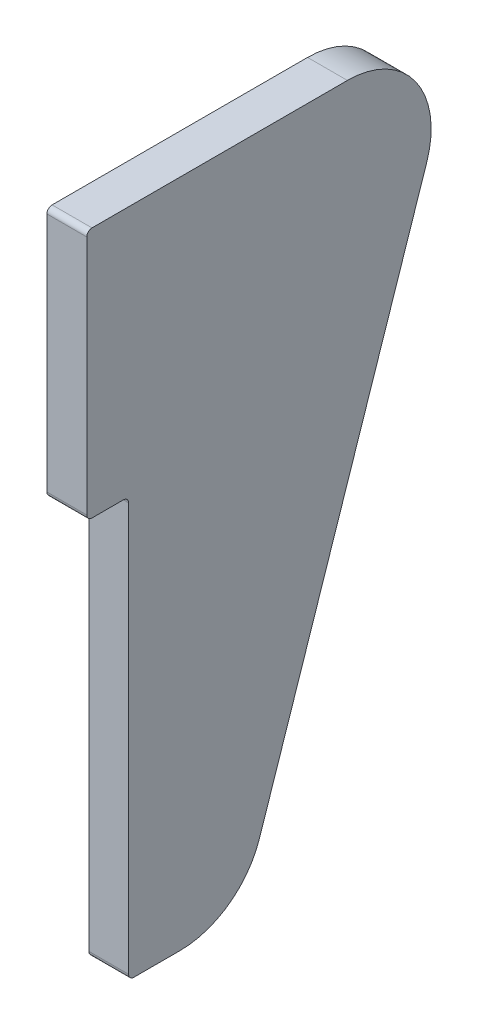
ISO-10303-21;
HEADER;
FILE_DESCRIPTION(('STEP AP214'),'2;1');
FILE_NAME('part.step','',(''),(''),'','','');
FILE_SCHEMA(('AUTOMOTIVE_DESIGN { 1 0 10303 214 1 1 1 1 }'));
ENDSEC;
DATA;
#1=APPLICATION_CONTEXT('core data for automotive mechanical design processes');
#2=APPLICATION_PROTOCOL_DEFINITION('international standard','automotive_design',2000,#1);
#3=PRODUCT_CONTEXT('',#1,'mechanical');
#4=PRODUCT('Part','Part','',(#3));
#5=PRODUCT_RELATED_PRODUCT_CATEGORY('part','',(#4));
#6=PRODUCT_DEFINITION_FORMATION('','',#4);
#7=PRODUCT_DEFINITION_CONTEXT('part definition',#1,'design');
#8=PRODUCT_DEFINITION('design','',#6,#7);
#9=PRODUCT_DEFINITION_SHAPE('','',#8);
#10=(LENGTH_UNIT() NAMED_UNIT(*) SI_UNIT(.MILLI.,.METRE.));
#11=(NAMED_UNIT(*) PLANE_ANGLE_UNIT() SI_UNIT($,.RADIAN.));
#12=(NAMED_UNIT(*) SI_UNIT($,.STERADIAN.) SOLID_ANGLE_UNIT());
#13=UNCERTAINTY_MEASURE_WITH_UNIT(LENGTH_MEASURE(1.E-05),#10,'distance_accuracy_value','');
#14=(GEOMETRIC_REPRESENTATION_CONTEXT(3) GLOBAL_UNCERTAINTY_ASSIGNED_CONTEXT((#13)) GLOBAL_UNIT_ASSIGNED_CONTEXT((#10,
#11,#12)) REPRESENTATION_CONTEXT('',''));
#15=CARTESIAN_POINT('',(0.,0.,0.));
#16=DIRECTION('',(0.,0.,1.));
#17=DIRECTION('',(1.,0.,0.));
#18=AXIS2_PLACEMENT_3D('',#15,#16,#17);
#19=CARTESIAN_POINT('',(-3.0226,0.,-25.4));
#20=DIRECTION('',(0.,1.,0.));
#21=DIRECTION('',(0.,0.,1.));
#22=AXIS2_PLACEMENT_3D('',#19,#20,#21);
#23=PLANE('',#22);
#24=DIRECTION('',(0.,0.,1.));
#25=VECTOR('',#24,1.);
#26=CARTESIAN_POINT('',(-3.0226,0.,0.));
#27=LINE('',#26,#25);
#28=CARTESIAN_POINT('',(-3.0226,0.,-16.5898456193103));
#29=VERTEX_POINT('',#28);
#30=CARTESIAN_POINT('',(-3.0226,0.,2.778125));
#31=VERTEX_POINT('',#30);
#32=EDGE_CURVE('E259',#29,#31,#27,.T.);
#33=ORIENTED_EDGE('',*,*,#32,.T.);
#34=DIRECTION('',(1.,0.,0.));
#35=VECTOR('',#34,1.);
#36=CARTESIAN_POINT('',(-3.0226,0.,2.778125));
#37=LINE('',#36,#35);
#38=CARTESIAN_POINT('',(0.,0.,2.778125));
#39=VERTEX_POINT('',#38);
#40=EDGE_CURVE('E191',#31,#39,#37,.T.);
#41=ORIENTED_EDGE('',*,*,#40,.T.);
#42=DIRECTION('',(0.,0.,1.));
#43=VECTOR('',#42,1.);
#44=CARTESIAN_POINT('',(0.,0.,-25.4));
#45=LINE('',#44,#43);
#46=CARTESIAN_POINT('',(0.,0.,-16.5898456193103));
#47=VERTEX_POINT('',#46);
#48=EDGE_CURVE('E174',#47,#39,#45,.T.);
#49=ORIENTED_EDGE('',*,*,#48,.F.);
#50=DIRECTION('',(1.,0.,0.));
#51=VECTOR('',#50,1.);
#52=CARTESIAN_POINT('',(-3.0226,0.,-16.5898456193103));
#53=LINE('',#52,#51);
#54=EDGE_CURVE('E188',#47,#29,#53,.F.);
#55=ORIENTED_EDGE('',*,*,#54,.T.);
#56=EDGE_LOOP('',(#33,#41,#49,#55));
#57=FACE_BOUND('',#56,.T.);
#58=ADVANCED_FACE('F45',(#57),#23,.T.);
#59=CARTESIAN_POINT('',(-3.0226,-50.8,-8.46666666666667));
#60=DIRECTION('',(0.,-0.316227766016838,-0.948683298050514));
#61=DIRECTION('',(0.,0.948683298050514,-0.316227766016838));
#62=AXIS2_PLACEMENT_3D('',#59,#60,#61);
#63=PLANE('',#62);
#64=DIRECTION('',(0.,0.948683298050514,-0.316227766016838));
#65=VECTOR('',#64,1.);
#66=CARTESIAN_POINT('',(0.,-50.8,-8.46666666666667));
#67=LINE('',#66,#65);
#68=CARTESIAN_POINT('',(0.,-46.4580463142069,-9.91398456193104));
#69=VERTEX_POINT('',#68);
#70=CARTESIAN_POINT('',(0.,-8.35804631420692,-22.613984561931));
#71=VERTEX_POINT('',#70);
#72=EDGE_CURVE('E147',#69,#71,#67,.T.);
#73=ORIENTED_EDGE('',*,*,#72,.F.);
#74=DIRECTION('',(1.,0.,0.));
#75=VECTOR('',#74,1.);
#76=CARTESIAN_POINT('',(-3.0226,-46.4580463142069,-9.91398456193104));
#77=LINE('',#76,#75);
#78=CARTESIAN_POINT('',(-3.0226,-46.4580463142069,-9.91398456193104));
#79=VERTEX_POINT('',#78);
#80=EDGE_CURVE('E156',#69,#79,#77,.F.);
#81=ORIENTED_EDGE('',*,*,#80,.T.);
#82=DIRECTION('',(0.,0.948683298050514,-0.316227766016838));
#83=VECTOR('',#82,1.);
#84=CARTESIAN_POINT('',(-3.0226,-50.8,-8.46666666666667));
#85=LINE('',#84,#83);
#86=CARTESIAN_POINT('',(-3.0226,-8.35804631420692,-22.613984561931));
#87=VERTEX_POINT('',#86);
#88=EDGE_CURVE('E166',#79,#87,#85,.T.);
#89=ORIENTED_EDGE('',*,*,#88,.T.);
#90=DIRECTION('',(1.,0.,0.));
#91=VECTOR('',#90,1.);
#92=CARTESIAN_POINT('',(-3.0226,-8.35804631420692,-22.613984561931));
#93=LINE('',#92,#91);
#94=EDGE_CURVE('E158',#87,#71,#93,.T.);
#95=ORIENTED_EDGE('',*,*,#94,.T.);
#96=EDGE_LOOP('',(#73,#81,#89,#95));
#97=FACE_BOUND('',#96,.T.);
#98=ADVANCED_FACE('F300',(#97),#63,.T.);
#99=CARTESIAN_POINT('',(-3.0226,-50.8,0.));
#100=DIRECTION('',(0.,-1.,0.));
#101=DIRECTION('',(0.,0.,-1.));
#102=AXIS2_PLACEMENT_3D('',#99,#100,#101);
#103=PLANE('',#102);
#104=DIRECTION('',(0.,0.,-1.));
#105=VECTOR('',#104,1.);
#106=CARTESIAN_POINT('',(0.,-50.8,0.));
#107=LINE('',#106,#105);
#108=CARTESIAN_POINT('',(0.,-50.8,-0.396875000000006));
#109=VERTEX_POINT('',#108);
#110=CARTESIAN_POINT('',(0.,-50.8,-3.88984561931027));
#111=VERTEX_POINT('',#110);
#112=EDGE_CURVE('E134',#109,#111,#107,.T.);
#113=ORIENTED_EDGE('',*,*,#112,.F.);
#114=DIRECTION('',(1.,0.,0.));
#115=VECTOR('',#114,1.);
#116=CARTESIAN_POINT('',(-3.0226,-50.8,-0.396875000000006));
#117=LINE('',#116,#115);
#118=CARTESIAN_POINT('',(-3.0226,-50.8,-0.396875000000006));
#119=VERTEX_POINT('',#118);
#120=EDGE_CURVE('E232',#109,#119,#117,.F.);
#121=ORIENTED_EDGE('',*,*,#120,.T.);
#122=DIRECTION('',(0.,0.,-1.));
#123=VECTOR('',#122,1.);
#124=CARTESIAN_POINT('',(-3.0226,-50.8,0.));
#125=LINE('',#124,#123);
#126=CARTESIAN_POINT('',(-3.0226,-50.8,-3.88984561931027));
#127=VERTEX_POINT('',#126);
#128=EDGE_CURVE('E163',#119,#127,#125,.T.);
#129=ORIENTED_EDGE('',*,*,#128,.T.);
#130=DIRECTION('',(1.,0.,0.));
#131=VECTOR('',#130,1.);
#132=CARTESIAN_POINT('',(-3.0226,-50.8,-3.88984561931027));
#133=LINE('',#132,#131);
#134=EDGE_CURVE('E155',#127,#111,#133,.T.);
#135=ORIENTED_EDGE('',*,*,#134,.T.);
#136=EDGE_LOOP('',(#113,#121,#129,#135));
#137=FACE_BOUND('',#136,.T.);
#138=ADVANCED_FACE('F161',(#137),#103,.T.);
#139=CARTESIAN_POINT('',(-3.0226,-19.05,0.));
#140=DIRECTION('',(0.,0.,1.));
#141=DIRECTION('',(0.,-1.,0.));
#142=AXIS2_PLACEMENT_3D('',#139,#140,#141);
#143=PLANE('',#142);
#144=DIRECTION('',(0.,-1.,0.));
#145=VECTOR('',#144,1.);
#146=CARTESIAN_POINT('',(0.,-19.05,0.));
#147=LINE('',#146,#145);
#148=CARTESIAN_POINT('',(0.,-19.446875,0.));
#149=VERTEX_POINT('',#148);
#150=CARTESIAN_POINT('',(0.,-50.403125,0.));
#151=VERTEX_POINT('',#150);
#152=EDGE_CURVE('E148',#149,#151,#147,.T.);
#153=ORIENTED_EDGE('',*,*,#152,.F.);
#154=DIRECTION('',(1.,0.,0.));
#155=VECTOR('',#154,1.);
#156=CARTESIAN_POINT('',(-3.0226,-19.446875,0.));
#157=LINE('',#156,#155);
#158=CARTESIAN_POINT('',(-3.0226,-19.446875,0.));
#159=VERTEX_POINT('',#158);
#160=EDGE_CURVE('E229',#149,#159,#157,.F.);
#161=ORIENTED_EDGE('',*,*,#160,.T.);
#162=DIRECTION('',(0.,-1.,0.));
#163=VECTOR('',#162,1.);
#164=CARTESIAN_POINT('',(-3.0226,-19.05,0.));
#165=LINE('',#164,#163);
#166=CARTESIAN_POINT('',(-3.0226,-50.403125,0.));
#167=VERTEX_POINT('',#166);
#168=EDGE_CURVE('E252',#159,#167,#165,.T.);
#169=ORIENTED_EDGE('',*,*,#168,.T.);
#170=DIRECTION('',(1.,0.,0.));
#171=VECTOR('',#170,1.);
#172=CARTESIAN_POINT('',(-3.0226,-50.403125,0.));
#173=LINE('',#172,#171);
#174=EDGE_CURVE('E225',#167,#151,#173,.T.);
#175=ORIENTED_EDGE('',*,*,#174,.T.);
#176=EDGE_LOOP('',(#153,#161,#169,#175));
#177=FACE_BOUND('',#176,.T.);
#178=ADVANCED_FACE('F242',(#177),#143,.T.);
#179=CARTESIAN_POINT('',(-3.0226,-19.05,0.));
#180=DIRECTION('',(0.,-1.,0.));
#181=DIRECTION('',(0.,0.,-1.));
#182=AXIS2_PLACEMENT_3D('',#179,#180,#181);
#183=PLANE('',#182);
#184=DIRECTION('',(0.,0.,-1.));
#185=VECTOR('',#184,1.);
#186=CARTESIAN_POINT('',(-3.0226,-19.05,0.));
#187=LINE('',#186,#185);
#188=CARTESIAN_POINT('',(-3.0226,-19.05,2.778125));
#189=VERTEX_POINT('',#188);
#190=CARTESIAN_POINT('',(-3.0226,-19.05,0.396874999999998));
#191=VERTEX_POINT('',#190);
#192=EDGE_CURVE('E249',#189,#191,#187,.T.);
#193=ORIENTED_EDGE('',*,*,#192,.T.);
#194=DIRECTION('',(1.,0.,0.));
#195=VECTOR('',#194,1.);
#196=CARTESIAN_POINT('',(0.,-19.05,0.396874999999998));
#197=LINE('',#196,#195);
#198=CARTESIAN_POINT('',(0.,-19.05,0.396874999999998));
#199=VERTEX_POINT('',#198);
#200=EDGE_CURVE('E221',#191,#199,#197,.T.);
#201=ORIENTED_EDGE('',*,*,#200,.T.);
#202=DIRECTION('',(0.,0.,-1.));
#203=VECTOR('',#202,1.);
#204=CARTESIAN_POINT('',(0.,-19.05,0.));
#205=LINE('',#204,#203);
#206=CARTESIAN_POINT('',(0.,-19.05,2.778125));
#207=VERTEX_POINT('',#206);
#208=EDGE_CURVE('E237',#207,#199,#205,.T.);
#209=ORIENTED_EDGE('',*,*,#208,.F.);
#210=DIRECTION('',(1.,0.,0.));
#211=VECTOR('',#210,1.);
#212=CARTESIAN_POINT('',(-3.0226,-19.05,2.778125));
#213=LINE('',#212,#211);
#214=EDGE_CURVE('E66',#207,#189,#213,.F.);
#215=ORIENTED_EDGE('',*,*,#214,.T.);
#216=EDGE_LOOP('',(#193,#201,#209,#215));
#217=FACE_BOUND('',#216,.T.);
#218=ADVANCED_FACE('F248',(#217),#183,.T.);
#219=CARTESIAN_POINT('',(-3.0226,0.,3.175));
#220=DIRECTION('',(0.,0.,1.));
#221=DIRECTION('',(0.,-1.,0.));
#222=AXIS2_PLACEMENT_3D('',#219,#220,#221);
#223=PLANE('',#222);
#224=DIRECTION('',(0.,-1.,0.));
#225=VECTOR('',#224,1.);
#226=CARTESIAN_POINT('',(0.,0.,3.175));
#227=LINE('',#226,#225);
#228=CARTESIAN_POINT('',(0.,-0.396875,3.175));
#229=VERTEX_POINT('',#228);
#230=CARTESIAN_POINT('',(0.,-18.653125,3.175));
#231=VERTEX_POINT('',#230);
#232=EDGE_CURVE('E265',#229,#231,#227,.T.);
#233=ORIENTED_EDGE('',*,*,#232,.F.);
#234=DIRECTION('',(1.,0.,0.));
#235=VECTOR('',#234,1.);
#236=CARTESIAN_POINT('',(-3.0226,-0.396875,3.175));
#237=LINE('',#236,#235);
#238=CARTESIAN_POINT('',(-3.0226,-0.396875,3.175));
#239=VERTEX_POINT('',#238);
#240=EDGE_CURVE('E207',#229,#239,#237,.F.);
#241=ORIENTED_EDGE('',*,*,#240,.T.);
#242=DIRECTION('',(0.,-1.,0.));
#243=VECTOR('',#242,1.);
#244=CARTESIAN_POINT('',(-3.0226,0.,3.175));
#245=LINE('',#244,#243);
#246=CARTESIAN_POINT('',(-3.0226,-18.653125,3.175));
#247=VERTEX_POINT('',#246);
#248=EDGE_CURVE('E253',#239,#247,#245,.T.);
#249=ORIENTED_EDGE('',*,*,#248,.T.);
#250=DIRECTION('',(1.,0.,0.));
#251=VECTOR('',#250,1.);
#252=CARTESIAN_POINT('',(-3.0226,-18.653125,3.175));
#253=LINE('',#252,#251);
#254=EDGE_CURVE('E203',#247,#231,#253,.T.);
#255=ORIENTED_EDGE('',*,*,#254,.T.);
#256=EDGE_LOOP('',(#233,#241,#249,#255));
#257=FACE_BOUND('',#256,.T.);
#258=ADVANCED_FACE('F286',(#257),#223,.T.);
#259=CARTESIAN_POINT('',(-3.0226,0.,0.));
#260=DIRECTION('',(1.,0.,0.));
#261=DIRECTION('',(0.,0.,-1.));
#262=AXIS2_PLACEMENT_3D('',#259,#260,#261);
#263=PLANE('',#262);
#264=ORIENTED_EDGE('',*,*,#248,.F.);
#265=CARTESIAN_POINT('',(-3.0226,-0.396875,2.778125));
#266=DIRECTION('',(1.,0.,0.));
#267=DIRECTION('',(0.,0.,-1.));
#268=AXIS2_PLACEMENT_3D('',#265,#266,#267);
#269=CIRCLE('',#268,0.396875);
#270=EDGE_CURVE('E216',#239,#31,#269,.F.);
#271=ORIENTED_EDGE('',*,*,#270,.T.);
#272=ORIENTED_EDGE('',*,*,#32,.F.);
#273=CARTESIAN_POINT('',(-3.0226,-6.35,-16.5898456193103));
#274=DIRECTION('',(1.,0.,0.));
#275=DIRECTION('',(0.,0.,-1.));
#276=AXIS2_PLACEMENT_3D('',#273,#274,#275);
#277=CIRCLE('',#276,6.35);
#278=EDGE_CURVE('E182',#29,#87,#277,.F.);
#279=ORIENTED_EDGE('',*,*,#278,.T.);
#280=ORIENTED_EDGE('',*,*,#88,.F.);
#281=CARTESIAN_POINT('',(-3.0226,-44.45,-3.88984561931027));
#282=DIRECTION('',(1.,0.,0.));
#283=DIRECTION('',(0.,0.,-1.));
#284=AXIS2_PLACEMENT_3D('',#281,#282,#283);
#285=CIRCLE('',#284,6.35);
#286=EDGE_CURVE('E185',#79,#127,#285,.F.);
#287=ORIENTED_EDGE('',*,*,#286,.T.);
#288=ORIENTED_EDGE('',*,*,#128,.F.);
#289=CARTESIAN_POINT('',(-3.0226,-50.403125,-0.396875000000006));
#290=DIRECTION('',(1.,0.,0.));
#291=DIRECTION('',(0.,0.,-1.));
#292=AXIS2_PLACEMENT_3D('',#289,#290,#291);
#293=CIRCLE('',#292,0.396875);
#294=EDGE_CURVE('E213',#119,#167,#293,.F.);
#295=ORIENTED_EDGE('',*,*,#294,.T.);
#296=ORIENTED_EDGE('',*,*,#168,.F.);
#297=CARTESIAN_POINT('',(-3.0226,-19.446875,0.396874999999998));
#298=DIRECTION('',(1.,0.,0.));
#299=DIRECTION('',(0.,0.,-1.));
#300=AXIS2_PLACEMENT_3D('',#297,#298,#299);
#301=CIRCLE('',#300,0.396875);
#302=EDGE_CURVE('E11',#159,#191,#301,.T.);
#303=ORIENTED_EDGE('',*,*,#302,.T.);
#304=ORIENTED_EDGE('',*,*,#192,.F.);
#305=CARTESIAN_POINT('',(-3.0226,-18.653125,2.778125));
#306=DIRECTION('',(1.,0.,0.));
#307=DIRECTION('',(0.,0.,-1.));
#308=AXIS2_PLACEMENT_3D('',#305,#306,#307);
#309=CIRCLE('',#308,0.396875);
#310=EDGE_CURVE('E210',#189,#247,#309,.F.);
#311=ORIENTED_EDGE('',*,*,#310,.T.);
#312=EDGE_LOOP('',(#264,#271,#272,#279,#280,#287,#288,#295,#296,#303,#304,#311));
#313=FACE_BOUND('',#312,.T.);
#314=ADVANCED_FACE('F290',(#313),#263,.F.);
#315=CARTESIAN_POINT('',(0.,0.,0.));
#316=DIRECTION('',(1.,0.,0.));
#317=DIRECTION('',(0.,0.,-1.));
#318=AXIS2_PLACEMENT_3D('',#315,#316,#317);
#319=PLANE('',#318);
#320=ORIENTED_EDGE('',*,*,#48,.T.);
#321=CARTESIAN_POINT('',(0.,-0.396875,2.778125));
#322=DIRECTION('',(1.,0.,0.));
#323=DIRECTION('',(0.,0.,-1.));
#324=AXIS2_PLACEMENT_3D('',#321,#322,#323);
#325=CIRCLE('',#324,0.396875);
#326=EDGE_CURVE('E200',#39,#229,#325,.T.);
#327=ORIENTED_EDGE('',*,*,#326,.T.);
#328=ORIENTED_EDGE('',*,*,#232,.T.);
#329=CARTESIAN_POINT('',(0.,-18.653125,2.778125));
#330=DIRECTION('',(1.,0.,0.));
#331=DIRECTION('',(0.,0.,-1.));
#332=AXIS2_PLACEMENT_3D('',#329,#330,#331);
#333=CIRCLE('',#332,0.396875);
#334=EDGE_CURVE('E195',#231,#207,#333,.T.);
#335=ORIENTED_EDGE('',*,*,#334,.T.);
#336=ORIENTED_EDGE('',*,*,#208,.T.);
#337=CARTESIAN_POINT('',(0.,-19.446875,0.396874999999998));
#338=DIRECTION('',(1.,0.,0.));
#339=DIRECTION('',(0.,0.,-1.));
#340=AXIS2_PLACEMENT_3D('',#337,#338,#339);
#341=CIRCLE('',#340,0.396875);
#342=EDGE_CURVE('E54',#199,#149,#341,.F.);
#343=ORIENTED_EDGE('',*,*,#342,.T.);
#344=ORIENTED_EDGE('',*,*,#152,.T.);
#345=CARTESIAN_POINT('',(0.,-50.403125,-0.396875000000006));
#346=DIRECTION('',(1.,0.,0.));
#347=DIRECTION('',(0.,0.,-1.));
#348=AXIS2_PLACEMENT_3D('',#345,#346,#347);
#349=CIRCLE('',#348,0.396875);
#350=EDGE_CURVE('E142',#151,#109,#349,.T.);
#351=ORIENTED_EDGE('',*,*,#350,.T.);
#352=ORIENTED_EDGE('',*,*,#112,.T.);
#353=CARTESIAN_POINT('',(0.,-44.45,-3.88984561931027));
#354=DIRECTION('',(1.,0.,0.));
#355=DIRECTION('',(0.,0.,-1.));
#356=AXIS2_PLACEMENT_3D('',#353,#354,#355);
#357=CIRCLE('',#356,6.35);
#358=EDGE_CURVE('E139',#111,#69,#357,.T.);
#359=ORIENTED_EDGE('',*,*,#358,.T.);
#360=ORIENTED_EDGE('',*,*,#72,.T.);
#361=CARTESIAN_POINT('',(0.,-6.35,-16.5898456193103));
#362=DIRECTION('',(1.,0.,0.));
#363=DIRECTION('',(0.,0.,-1.));
#364=AXIS2_PLACEMENT_3D('',#361,#362,#363);
#365=CIRCLE('',#364,6.35);
#366=EDGE_CURVE('E159',#71,#47,#365,.T.);
#367=ORIENTED_EDGE('',*,*,#366,.T.);
#368=EDGE_LOOP('',(#320,#327,#328,#335,#336,#343,#344,#351,#352,#359,#360,#367));
#369=FACE_BOUND('',#368,.T.);
#370=ADVANCED_FACE('F137',(#369),#319,.T.);
#371=CARTESIAN_POINT('',(-3.0226,-44.45,-3.88984561931027));
#372=DIRECTION('',(1.,0.,0.));
#373=DIRECTION('',(0.,0.,-1.));
#374=AXIS2_PLACEMENT_3D('',#371,#372,#373);
#375=CYLINDRICAL_SURFACE('',#374,6.35);
#376=ORIENTED_EDGE('',*,*,#286,.F.);
#377=ORIENTED_EDGE('',*,*,#80,.F.);
#378=ORIENTED_EDGE('',*,*,#358,.F.);
#379=ORIENTED_EDGE('',*,*,#134,.F.);
#380=EDGE_LOOP('',(#376,#377,#378,#379));
#381=FACE_BOUND('',#380,.T.);
#382=ADVANCED_FACE('F154',(#381),#375,.T.);
#383=CARTESIAN_POINT('',(-3.0226,-6.35,-16.5898456193103));
#384=DIRECTION('',(1.,0.,0.));
#385=DIRECTION('',(0.,0.,-1.));
#386=AXIS2_PLACEMENT_3D('',#383,#384,#385);
#387=CYLINDRICAL_SURFACE('',#386,6.35);
#388=ORIENTED_EDGE('',*,*,#278,.F.);
#389=ORIENTED_EDGE('',*,*,#54,.F.);
#390=ORIENTED_EDGE('',*,*,#366,.F.);
#391=ORIENTED_EDGE('',*,*,#94,.F.);
#392=EDGE_LOOP('',(#388,#389,#390,#391));
#393=FACE_BOUND('',#392,.T.);
#394=ADVANCED_FACE('F317',(#393),#387,.T.);
#395=CARTESIAN_POINT('',(-3.0226,-0.396875,2.778125));
#396=DIRECTION('',(1.,0.,0.));
#397=DIRECTION('',(0.,0.,-1.));
#398=AXIS2_PLACEMENT_3D('',#395,#396,#397);
#399=CYLINDRICAL_SURFACE('',#398,0.396875);
#400=ORIENTED_EDGE('',*,*,#270,.F.);
#401=ORIENTED_EDGE('',*,*,#240,.F.);
#402=ORIENTED_EDGE('',*,*,#326,.F.);
#403=ORIENTED_EDGE('',*,*,#40,.F.);
#404=EDGE_LOOP('',(#400,#401,#402,#403));
#405=FACE_BOUND('',#404,.T.);
#406=ADVANCED_FACE('F282',(#405),#399,.T.);
#407=CARTESIAN_POINT('',(-3.0226,-19.446875,0.396874999999998));
#408=DIRECTION('',(-1.,0.,0.));
#409=DIRECTION('',(0.,0.,1.));
#410=AXIS2_PLACEMENT_3D('',#407,#408,#409);
#411=CYLINDRICAL_SURFACE('',#410,0.396875);
#412=ORIENTED_EDGE('',*,*,#302,.F.);
#413=ORIENTED_EDGE('',*,*,#160,.F.);
#414=ORIENTED_EDGE('',*,*,#342,.F.);
#415=ORIENTED_EDGE('',*,*,#200,.F.);
#416=EDGE_LOOP('',(#412,#413,#414,#415));
#417=FACE_BOUND('',#416,.T.);
#418=ADVANCED_FACE('F247',(#417),#411,.F.);
#419=CARTESIAN_POINT('',(-3.0226,-50.403125,-0.396875000000006));
#420=DIRECTION('',(1.,0.,0.));
#421=DIRECTION('',(0.,0.,-1.));
#422=AXIS2_PLACEMENT_3D('',#419,#420,#421);
#423=CYLINDRICAL_SURFACE('',#422,0.396875);
#424=ORIENTED_EDGE('',*,*,#294,.F.);
#425=ORIENTED_EDGE('',*,*,#120,.F.);
#426=ORIENTED_EDGE('',*,*,#350,.F.);
#427=ORIENTED_EDGE('',*,*,#174,.F.);
#428=EDGE_LOOP('',(#424,#425,#426,#427));
#429=FACE_BOUND('',#428,.T.);
#430=ADVANCED_FACE('F323',(#429),#423,.T.);
#431=CARTESIAN_POINT('',(-3.0226,-18.653125,2.778125));
#432=DIRECTION('',(1.,0.,0.));
#433=DIRECTION('',(0.,0.,-1.));
#434=AXIS2_PLACEMENT_3D('',#431,#432,#433);
#435=CYLINDRICAL_SURFACE('',#434,0.396875);
#436=ORIENTED_EDGE('',*,*,#310,.F.);
#437=ORIENTED_EDGE('',*,*,#214,.F.);
#438=ORIENTED_EDGE('',*,*,#334,.F.);
#439=ORIENTED_EDGE('',*,*,#254,.F.);
#440=EDGE_LOOP('',(#436,#437,#438,#439));
#441=FACE_BOUND('',#440,.T.);
#442=ADVANCED_FACE('F47',(#441),#435,.T.);
#443=CLOSED_SHELL('',(#58,#98,#138,#178,#218,#258,#314,#370,#382,#394,#406,#418,#430,#442));
#444=MANIFOLD_SOLID_BREP('B2',#443);
#445=ADVANCED_BREP_SHAPE_REPRESENTATION('',(#18,#444),#14);
#446=SHAPE_DEFINITION_REPRESENTATION(#9,#445);
ENDSEC;
END-ISO-10303-21;
